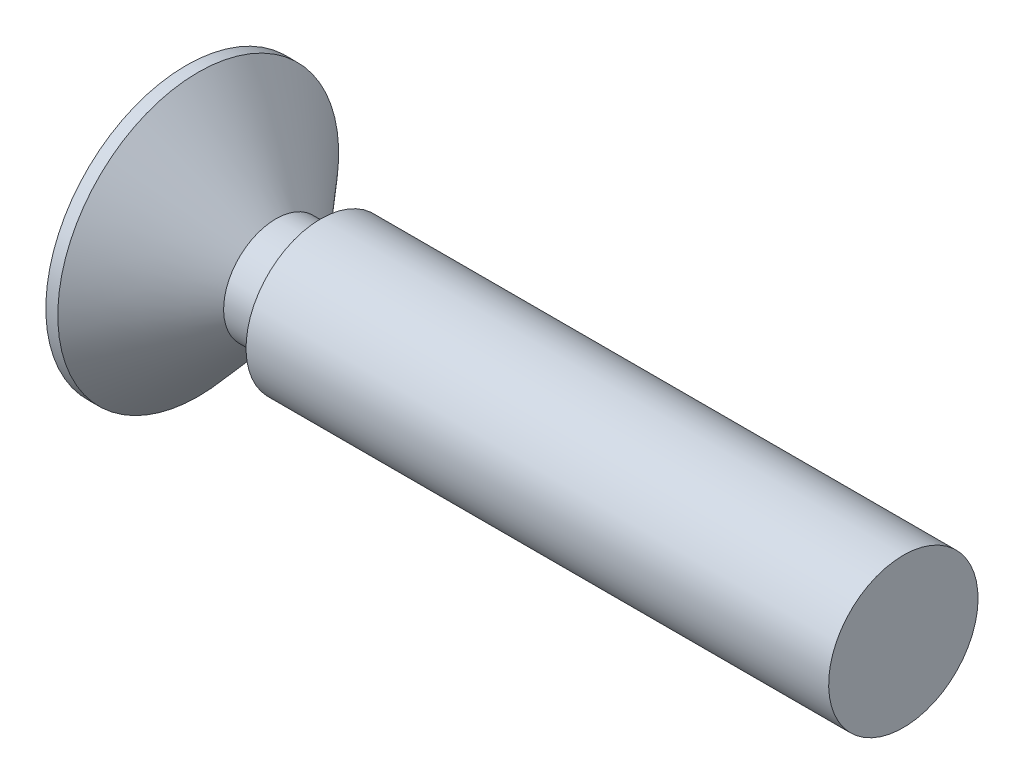
ISO-10303-21;
HEADER;
FILE_DESCRIPTION(('STEP AP214'),'2;1');
FILE_NAME('part.step','',(''),(''),'','','');
FILE_SCHEMA(('AUTOMOTIVE_DESIGN { 1 0 10303 214 1 1 1 1 }'));
ENDSEC;
DATA;
#1=APPLICATION_CONTEXT('core data for automotive mechanical design processes');
#2=APPLICATION_PROTOCOL_DEFINITION('international standard','automotive_design',2000,#1);
#3=PRODUCT_CONTEXT('',#1,'mechanical');
#4=PRODUCT('Part','Part','',(#3));
#5=PRODUCT_RELATED_PRODUCT_CATEGORY('part','',(#4));
#6=PRODUCT_DEFINITION_FORMATION('','',#4);
#7=PRODUCT_DEFINITION_CONTEXT('part definition',#1,'design');
#8=PRODUCT_DEFINITION('design','',#6,#7);
#9=PRODUCT_DEFINITION_SHAPE('','',#8);
#10=(LENGTH_UNIT() NAMED_UNIT(*) SI_UNIT(.MILLI.,.METRE.));
#11=(NAMED_UNIT(*) PLANE_ANGLE_UNIT() SI_UNIT($,.RADIAN.));
#12=(NAMED_UNIT(*) SI_UNIT($,.STERADIAN.) SOLID_ANGLE_UNIT());
#13=UNCERTAINTY_MEASURE_WITH_UNIT(LENGTH_MEASURE(1.E-05),#10,'distance_accuracy_value','');
#14=(GEOMETRIC_REPRESENTATION_CONTEXT(3) GLOBAL_UNCERTAINTY_ASSIGNED_CONTEXT((#13)) GLOBAL_UNIT_ASSIGNED_CONTEXT((#10,
#11,#12)) REPRESENTATION_CONTEXT('',''));
#15=CARTESIAN_POINT('',(0.,0.,0.));
#16=DIRECTION('',(0.,0.,1.));
#17=DIRECTION('',(1.,0.,0.));
#18=AXIS2_PLACEMENT_3D('',#15,#16,#17);
#19=CARTESIAN_POINT('',(0.,0.,0.));
#20=DIRECTION('',(1.,0.,0.));
#21=DIRECTION('',(0.,1.,0.));
#22=AXIS2_PLACEMENT_3D('',#19,#20,#21);
#23=PLANE('',#22);
#24=CARTESIAN_POINT('',(0.,0.,0.));
#25=DIRECTION('',(1.,0.,0.));
#26=DIRECTION('',(0.,1.,0.));
#27=AXIS2_PLACEMENT_3D('',#24,#25,#26);
#28=CIRCLE('',#27,1.25);
#29=CARTESIAN_POINT('',(0.,1.25,0.));
#30=VERTEX_POINT('',#29);
#31=EDGE_CURVE('E11',#30,#30,#28,.T.);
#32=ORIENTED_EDGE('',*,*,#31,.T.);
#33=EDGE_LOOP('',(#32));
#34=FACE_BOUND('',#33,.T.);
#35=ADVANCED_FACE('F42',(#34),#23,.T.);
#36=CARTESIAN_POINT('',(0.,0.,0.));
#37=DIRECTION('',(1.,0.,0.));
#38=DIRECTION('',(0.,1.,0.));
#39=AXIS2_PLACEMENT_3D('',#36,#37,#38);
#40=CYLINDRICAL_SURFACE('',#39,1.25);
#41=CARTESIAN_POINT('',(-9.75,0.,0.));
#42=DIRECTION('',(1.,0.,0.));
#43=DIRECTION('',(0.,1.,0.));
#44=AXIS2_PLACEMENT_3D('',#41,#42,#43);
#45=CIRCLE('',#44,1.25000000000001);
#46=CARTESIAN_POINT('',(-9.75,1.25,0.));
#47=VERTEX_POINT('',#46);
#48=EDGE_CURVE('E50',#47,#47,#45,.T.);
#49=ORIENTED_EDGE('',*,*,#48,.T.);
#50=EDGE_LOOP('',(#49));
#51=FACE_BOUND('',#50,.T.);
#52=ORIENTED_EDGE('',*,*,#31,.F.);
#53=EDGE_LOOP('',(#52));
#54=FACE_BOUND('',#53,.T.);
#55=ADVANCED_FACE('F315',(#51,#54),#40,.T.);
#56=CARTESIAN_POINT('',(-9.75,1.25,0.));
#57=DIRECTION('',(-1.,0.,0.));
#58=DIRECTION('',(0.,-1.,0.));
#59=AXIS2_PLACEMENT_3D('',#56,#57,#58);
#60=PLANE('',#59);
#61=CARTESIAN_POINT('',(-9.75,0.,0.));
#62=DIRECTION('',(1.,0.,0.));
#63=DIRECTION('',(0.,1.,0.));
#64=AXIS2_PLACEMENT_3D('',#61,#62,#63);
#65=CIRCLE('',#64,0.875000000000006);
#66=CARTESIAN_POINT('',(-9.75,0.875000000000004,0.));
#67=VERTEX_POINT('',#66);
#68=EDGE_CURVE('E308',#67,#67,#65,.T.);
#69=ORIENTED_EDGE('',*,*,#68,.T.);
#70=EDGE_LOOP('',(#69));
#71=FACE_BOUND('',#70,.T.);
#72=ORIENTED_EDGE('',*,*,#48,.F.);
#73=EDGE_LOOP('',(#72));
#74=FACE_BOUND('',#73,.T.);
#75=ADVANCED_FACE('F318',(#71,#74),#60,.T.);
#76=CARTESIAN_POINT('',(0.,0.,0.));
#77=DIRECTION('',(1.,0.,0.));
#78=DIRECTION('',(0.,1.,0.));
#79=AXIS2_PLACEMENT_3D('',#76,#77,#78);
#80=CYLINDRICAL_SURFACE('',#79,0.875000000000006);
#81=CARTESIAN_POINT('',(-10.5,0.,0.));
#82=DIRECTION('',(1.,0.,0.));
#83=DIRECTION('',(0.,1.,0.));
#84=AXIS2_PLACEMENT_3D('',#81,#82,#83);
#85=CIRCLE('',#84,0.875000000000006);
#86=CARTESIAN_POINT('',(-10.5,0.875000000000004,0.));
#87=VERTEX_POINT('',#86);
#88=EDGE_CURVE('E304',#87,#87,#85,.T.);
#89=ORIENTED_EDGE('',*,*,#88,.T.);
#90=EDGE_LOOP('',(#89));
#91=FACE_BOUND('',#90,.T.);
#92=ORIENTED_EDGE('',*,*,#68,.F.);
#93=EDGE_LOOP('',(#92));
#94=FACE_BOUND('',#93,.T.);
#95=ADVANCED_FACE('F320',(#91,#94),#80,.T.);
#96=CARTESIAN_POINT('',(-10.5,0.,0.));
#97=DIRECTION('',(-1.,0.,0.));
#98=DIRECTION('',(0.,-1.,0.));
#99=AXIS2_PLACEMENT_3D('',#96,#97,#98);
#100=CONICAL_SURFACE('',#99,0.875000000000006,0.848377825830391);
#101=CARTESIAN_POINT('',(-11.8,0.,0.));
#102=DIRECTION('',(1.,0.,0.));
#103=DIRECTION('',(0.,1.,0.));
#104=AXIS2_PLACEMENT_3D('',#101,#102,#103);
#105=CIRCLE('',#104,2.35);
#106=CARTESIAN_POINT('',(-11.8,2.35,0.));
#107=VERTEX_POINT('',#106);
#108=EDGE_CURVE('E300',#107,#107,#105,.T.);
#109=ORIENTED_EDGE('',*,*,#108,.T.);
#110=EDGE_LOOP('',(#109));
#111=FACE_BOUND('',#110,.T.);
#112=ORIENTED_EDGE('',*,*,#88,.F.);
#113=EDGE_LOOP('',(#112));
#114=FACE_BOUND('',#113,.T.);
#115=ADVANCED_FACE('F327',(#111,#114),#100,.T.);
#116=CARTESIAN_POINT('',(0.,0.,0.));
#117=DIRECTION('',(1.,0.,0.));
#118=DIRECTION('',(0.,1.,0.));
#119=AXIS2_PLACEMENT_3D('',#116,#117,#118);
#120=CYLINDRICAL_SURFACE('',#119,2.35);
#121=CARTESIAN_POINT('',(-12.,0.,0.));
#122=DIRECTION('',(1.,0.,0.));
#123=DIRECTION('',(0.,1.,0.));
#124=AXIS2_PLACEMENT_3D('',#121,#122,#123);
#125=CIRCLE('',#124,2.35);
#126=CARTESIAN_POINT('',(-12.,2.35,0.));
#127=VERTEX_POINT('',#126);
#128=EDGE_CURVE('E257',#127,#127,#125,.T.);
#129=ORIENTED_EDGE('',*,*,#128,.T.);
#130=EDGE_LOOP('',(#129));
#131=FACE_BOUND('',#130,.T.);
#132=ORIENTED_EDGE('',*,*,#108,.F.);
#133=EDGE_LOOP('',(#132));
#134=FACE_BOUND('',#133,.T.);
#135=ADVANCED_FACE('F353',(#131,#134),#120,.T.);
#136=CARTESIAN_POINT('',(-12.,2.35,0.));
#137=DIRECTION('',(-1.,0.,0.));
#138=DIRECTION('',(0.,-1.,0.));
#139=AXIS2_PLACEMENT_3D('',#136,#137,#138);
#140=PLANE('',#139);
#141=DIRECTION('',(0.,-1.,0.));
#142=VECTOR('',#141,1.);
#143=CARTESIAN_POINT('',(-12.,1.5,-0.3125));
#144=LINE('',#143,#142);
#145=CARTESIAN_POINT('',(-12.,1.5,-0.3125));
#146=VERTEX_POINT('',#145);
#147=CARTESIAN_POINT('',(-12.,0.562499999999999,-0.3125));
#148=VERTEX_POINT('',#147);
#149=EDGE_CURVE('E57',#146,#148,#144,.T.);
#150=ORIENTED_EDGE('',*,*,#149,.F.);
#151=DIRECTION('',(0.,0.,-1.));
#152=VECTOR('',#151,1.);
#153=CARTESIAN_POINT('',(-12.,1.5,-0.3125));
#154=LINE('',#153,#152);
#155=CARTESIAN_POINT('',(-12.,1.5,0.3125));
#156=VERTEX_POINT('',#155);
#157=EDGE_CURVE('E251',#156,#146,#154,.T.);
#158=ORIENTED_EDGE('',*,*,#157,.F.);
#159=DIRECTION('',(0.,1.,0.));
#160=VECTOR('',#159,1.);
#161=CARTESIAN_POINT('',(-12.,1.5,0.3125));
#162=LINE('',#161,#160);
#163=CARTESIAN_POINT('',(-12.,0.562499999999999,0.3125));
#164=VERTEX_POINT('',#163);
#165=EDGE_CURVE('E248',#164,#156,#162,.T.);
#166=ORIENTED_EDGE('',*,*,#165,.F.);
#167=CARTESIAN_POINT('',(-12.,0.562499999999998,0.5625));
#168=DIRECTION('',(1.,0.,0.));
#169=DIRECTION('',(0.,1.,0.));
#170=AXIS2_PLACEMENT_3D('',#167,#168,#169);
#171=CIRCLE('',#170,0.25);
#172=CARTESIAN_POINT('',(-12.,0.312499999999998,0.5625));
#173=VERTEX_POINT('',#172);
#174=EDGE_CURVE('E165',#173,#164,#171,.T.);
#175=ORIENTED_EDGE('',*,*,#174,.F.);
#176=DIRECTION('',(0.,0.,-1.));
#177=VECTOR('',#176,1.);
#178=CARTESIAN_POINT('',(-12.,0.312499999999999,0.5625));
#179=LINE('',#178,#177);
#180=CARTESIAN_POINT('',(-12.,0.312499999999999,1.5));
#181=VERTEX_POINT('',#180);
#182=EDGE_CURVE('E242',#181,#173,#179,.T.);
#183=ORIENTED_EDGE('',*,*,#182,.F.);
#184=DIRECTION('',(0.,1.,0.));
#185=VECTOR('',#184,1.);
#186=CARTESIAN_POINT('',(-12.,0.312499999999999,1.5));
#187=LINE('',#186,#185);
#188=CARTESIAN_POINT('',(-12.,-0.312500000000001,1.5));
#189=VERTEX_POINT('',#188);
#190=EDGE_CURVE('E238',#189,#181,#187,.T.);
#191=ORIENTED_EDGE('',*,*,#190,.F.);
#192=DIRECTION('',(0.,0.,1.));
#193=VECTOR('',#192,1.);
#194=CARTESIAN_POINT('',(-12.,-0.312500000000001,0.562500000000001));
#195=LINE('',#194,#193);
#196=CARTESIAN_POINT('',(-12.,-0.312500000000001,0.562500000000001));
#197=VERTEX_POINT('',#196);
#198=EDGE_CURVE('E234',#197,#189,#195,.T.);
#199=ORIENTED_EDGE('',*,*,#198,.F.);
#200=CARTESIAN_POINT('',(-12.,-0.562500000000001,0.5625));
#201=DIRECTION('',(1.,0.,0.));
#202=DIRECTION('',(0.,1.,0.));
#203=AXIS2_PLACEMENT_3D('',#200,#201,#202);
#204=CIRCLE('',#203,0.25);
#205=CARTESIAN_POINT('',(-12.,-0.562500000000002,0.3125));
#206=VERTEX_POINT('',#205);
#207=EDGE_CURVE('E230',#206,#197,#204,.T.);
#208=ORIENTED_EDGE('',*,*,#207,.F.);
#209=DIRECTION('',(0.,1.,0.));
#210=VECTOR('',#209,1.);
#211=CARTESIAN_POINT('',(-12.,-0.562500000000002,0.312500000000001));
#212=LINE('',#211,#210);
#213=CARTESIAN_POINT('',(-12.,-1.5,0.3125));
#214=VERTEX_POINT('',#213);
#215=EDGE_CURVE('E226',#214,#206,#212,.T.);
#216=ORIENTED_EDGE('',*,*,#215,.F.);
#217=DIRECTION('',(0.,0.,1.));
#218=VECTOR('',#217,1.);
#219=CARTESIAN_POINT('',(-12.,-1.5,-0.3125));
#220=LINE('',#219,#218);
#221=CARTESIAN_POINT('',(-12.,-1.5,-0.3125));
#222=VERTEX_POINT('',#221);
#223=EDGE_CURVE('E222',#222,#214,#220,.T.);
#224=ORIENTED_EDGE('',*,*,#223,.F.);
#225=DIRECTION('',(0.,-1.,0.));
#226=VECTOR('',#225,1.);
#227=CARTESIAN_POINT('',(-12.,-0.562500000000002,-0.3125));
#228=LINE('',#227,#226);
#229=CARTESIAN_POINT('',(-12.,-0.562500000000002,-0.3125));
#230=VERTEX_POINT('',#229);
#231=EDGE_CURVE('E218',#230,#222,#228,.T.);
#232=ORIENTED_EDGE('',*,*,#231,.F.);
#233=CARTESIAN_POINT('',(-12.,-0.562500000000001,-0.5625));
#234=DIRECTION('',(1.,0.,0.));
#235=DIRECTION('',(0.,-1.,0.));
#236=AXIS2_PLACEMENT_3D('',#233,#234,#235);
#237=CIRCLE('',#236,0.25);
#238=CARTESIAN_POINT('',(-12.,-0.312500000000001,-0.5625));
#239=VERTEX_POINT('',#238);
#240=EDGE_CURVE('E214',#239,#230,#237,.T.);
#241=ORIENTED_EDGE('',*,*,#240,.F.);
#242=DIRECTION('',(0.,0.,1.));
#243=VECTOR('',#242,1.);
#244=CARTESIAN_POINT('',(-12.,-0.312500000000001,-1.5));
#245=LINE('',#244,#243);
#246=CARTESIAN_POINT('',(-12.,-0.312500000000001,-1.5));
#247=VERTEX_POINT('',#246);
#248=EDGE_CURVE('E210',#247,#239,#245,.T.);
#249=ORIENTED_EDGE('',*,*,#248,.F.);
#250=DIRECTION('',(0.,-1.,0.));
#251=VECTOR('',#250,1.);
#252=CARTESIAN_POINT('',(-12.,0.312499999999999,-1.5));
#253=LINE('',#252,#251);
#254=CARTESIAN_POINT('',(-12.,0.312499999999999,-1.5));
#255=VERTEX_POINT('',#254);
#256=EDGE_CURVE('E206',#255,#247,#253,.T.);
#257=ORIENTED_EDGE('',*,*,#256,.F.);
#258=DIRECTION('',(0.,0.,-1.));
#259=VECTOR('',#258,1.);
#260=CARTESIAN_POINT('',(-12.,0.312499999999999,-1.5));
#261=LINE('',#260,#259);
#262=CARTESIAN_POINT('',(-12.,0.312499999999999,-0.5625));
#263=VERTEX_POINT('',#262);
#264=EDGE_CURVE('E203',#263,#255,#261,.T.);
#265=ORIENTED_EDGE('',*,*,#264,.F.);
#266=CARTESIAN_POINT('',(-12.,0.562499999999998,-0.5625));
#267=DIRECTION('',(1.,0.,0.));
#268=DIRECTION('',(0.,1.,0.));
#269=AXIS2_PLACEMENT_3D('',#266,#267,#268);
#270=CIRCLE('',#269,0.25);
#271=EDGE_CURVE('E199',#148,#263,#270,.T.);
#272=ORIENTED_EDGE('',*,*,#271,.F.);
#273=EDGE_LOOP('',(#150,#158,#166,#175,#183,#191,#199,#208,#216,#224,#232,#241,#249,#257,#265,#272));
#274=FACE_BOUND('',#273,.T.);
#275=ORIENTED_EDGE('',*,*,#128,.F.);
#276=EDGE_LOOP('',(#275));
#277=FACE_BOUND('',#276,.T.);
#278=ADVANCED_FACE('F362',(#274,#277),#140,.T.);
#279=CARTESIAN_POINT('',(-11.25,1.5,-0.3125));
#280=DIRECTION('',(0.,0.,-1.));
#281=DIRECTION('',(-1.,0.,0.));
#282=AXIS2_PLACEMENT_3D('',#279,#280,#281);
#283=PLANE('',#282);
#284=ORIENTED_EDGE('',*,*,#149,.T.);
#285=DIRECTION('',(-1.,0.,0.));
#286=VECTOR('',#285,1.);
#287=CARTESIAN_POINT('',(-11.25,0.562499999999999,-0.3125));
#288=LINE('',#287,#286);
#289=CARTESIAN_POINT('',(-11.25,0.562499999999999,-0.3125));
#290=VERTEX_POINT('',#289);
#291=EDGE_CURVE('E117',#290,#148,#288,.T.);
#292=ORIENTED_EDGE('',*,*,#291,.F.);
#293=DIRECTION('',(0.,-1.,0.));
#294=VECTOR('',#293,1.);
#295=CARTESIAN_POINT('',(-11.25,1.5,-0.3125));
#296=LINE('',#295,#294);
#297=CARTESIAN_POINT('',(-11.25,1.5,-0.3125));
#298=VERTEX_POINT('',#297);
#299=EDGE_CURVE('E254',#298,#290,#296,.T.);
#300=ORIENTED_EDGE('',*,*,#299,.F.);
#301=DIRECTION('',(-1.,0.,0.));
#302=VECTOR('',#301,1.);
#303=CARTESIAN_POINT('',(-11.25,1.5,-0.3125));
#304=LINE('',#303,#302);
#305=EDGE_CURVE('E65',#298,#146,#304,.T.);
#306=ORIENTED_EDGE('',*,*,#305,.T.);
#307=EDGE_LOOP('',(#284,#292,#300,#306));
#308=FACE_BOUND('',#307,.T.);
#309=ADVANCED_FACE('F371',(#308),#283,.F.);
#310=CARTESIAN_POINT('',(-11.25,1.5,-0.3125));
#311=DIRECTION('',(0.,1.,0.));
#312=DIRECTION('',(-1.,0.,0.));
#313=AXIS2_PLACEMENT_3D('',#310,#311,#312);
#314=PLANE('',#313);
#315=ORIENTED_EDGE('',*,*,#157,.T.);
#316=ORIENTED_EDGE('',*,*,#305,.F.);
#317=DIRECTION('',(0.,0.,-1.));
#318=VECTOR('',#317,1.);
#319=CARTESIAN_POINT('',(-11.25,1.5,-0.3125));
#320=LINE('',#319,#318);
#321=CARTESIAN_POINT('',(-11.25,1.5,0.3125));
#322=VERTEX_POINT('',#321);
#323=EDGE_CURVE('E179',#322,#298,#320,.T.);
#324=ORIENTED_EDGE('',*,*,#323,.F.);
#325=DIRECTION('',(-1.,0.,0.));
#326=VECTOR('',#325,1.);
#327=CARTESIAN_POINT('',(-11.25,1.5,0.3125));
#328=LINE('',#327,#326);
#329=EDGE_CURVE('E170',#322,#156,#328,.T.);
#330=ORIENTED_EDGE('',*,*,#329,.T.);
#331=EDGE_LOOP('',(#315,#316,#324,#330));
#332=FACE_BOUND('',#331,.T.);
#333=ADVANCED_FACE('F380',(#332),#314,.F.);
#334=CARTESIAN_POINT('',(-11.25,1.5,0.3125));
#335=DIRECTION('',(0.,0.,1.));
#336=DIRECTION('',(0.,-1.,0.));
#337=AXIS2_PLACEMENT_3D('',#334,#335,#336);
#338=PLANE('',#337);
#339=ORIENTED_EDGE('',*,*,#165,.T.);
#340=ORIENTED_EDGE('',*,*,#329,.F.);
#341=DIRECTION('',(0.,1.,0.));
#342=VECTOR('',#341,1.);
#343=CARTESIAN_POINT('',(-11.25,1.5,0.3125));
#344=LINE('',#343,#342);
#345=CARTESIAN_POINT('',(-11.25,0.562499999999999,0.3125));
#346=VERTEX_POINT('',#345);
#347=EDGE_CURVE('E174',#346,#322,#344,.T.);
#348=ORIENTED_EDGE('',*,*,#347,.F.);
#349=DIRECTION('',(-1.,0.,0.));
#350=VECTOR('',#349,1.);
#351=CARTESIAN_POINT('',(-11.25,0.562499999999999,0.3125));
#352=LINE('',#351,#350);
#353=EDGE_CURVE('E158',#346,#164,#352,.T.);
#354=ORIENTED_EDGE('',*,*,#353,.T.);
#355=EDGE_LOOP('',(#339,#340,#348,#354));
#356=FACE_BOUND('',#355,.T.);
#357=ADVANCED_FACE('F175',(#356),#338,.F.);
#358=CARTESIAN_POINT('',(-11.25,0.562499999999998,0.5625));
#359=DIRECTION('',(-1.,0.,0.));
#360=DIRECTION('',(0.,-1.,0.));
#361=AXIS2_PLACEMENT_3D('',#358,#359,#360);
#362=CYLINDRICAL_SURFACE('',#361,0.25);
#363=ORIENTED_EDGE('',*,*,#174,.T.);
#364=ORIENTED_EDGE('',*,*,#353,.F.);
#365=CARTESIAN_POINT('',(-11.25,0.562499999999998,0.5625));
#366=DIRECTION('',(1.,0.,0.));
#367=DIRECTION('',(0.,1.,0.));
#368=AXIS2_PLACEMENT_3D('',#365,#366,#367);
#369=CIRCLE('',#368,0.25);
#370=CARTESIAN_POINT('',(-11.25,0.312499999999998,0.5625));
#371=VERTEX_POINT('',#370);
#372=EDGE_CURVE('E162',#371,#346,#369,.T.);
#373=ORIENTED_EDGE('',*,*,#372,.F.);
#374=DIRECTION('',(-1.,0.,0.));
#375=VECTOR('',#374,1.);
#376=CARTESIAN_POINT('',(-11.25,0.312499999999998,0.5625));
#377=LINE('',#376,#375);
#378=EDGE_CURVE('E171',#371,#173,#377,.T.);
#379=ORIENTED_EDGE('',*,*,#378,.T.);
#380=EDGE_LOOP('',(#363,#364,#373,#379));
#381=FACE_BOUND('',#380,.T.);
#382=ADVANCED_FACE('F160',(#381),#362,.T.);
#383=CARTESIAN_POINT('',(-11.25,0.312499999999999,0.5625));
#384=DIRECTION('',(0.,1.,0.));
#385=DIRECTION('',(-1.,0.,0.));
#386=AXIS2_PLACEMENT_3D('',#383,#384,#385);
#387=PLANE('',#386);
#388=ORIENTED_EDGE('',*,*,#182,.T.);
#389=ORIENTED_EDGE('',*,*,#378,.F.);
#390=DIRECTION('',(0.,0.,-1.));
#391=VECTOR('',#390,1.);
#392=CARTESIAN_POINT('',(-11.25,0.312499999999999,0.5625));
#393=LINE('',#392,#391);
#394=CARTESIAN_POINT('',(-11.25,0.312499999999999,1.5));
#395=VERTEX_POINT('',#394);
#396=EDGE_CURVE('E185',#395,#371,#393,.T.);
#397=ORIENTED_EDGE('',*,*,#396,.F.);
#398=DIRECTION('',(-1.,0.,0.));
#399=VECTOR('',#398,1.);
#400=CARTESIAN_POINT('',(-11.25,0.312499999999999,1.5));
#401=LINE('',#400,#399);
#402=EDGE_CURVE('E262',#395,#181,#401,.T.);
#403=ORIENTED_EDGE('',*,*,#402,.T.);
#404=EDGE_LOOP('',(#388,#389,#397,#403));
#405=FACE_BOUND('',#404,.T.);
#406=ADVANCED_FACE('F402',(#405),#387,.F.);
#407=CARTESIAN_POINT('',(-11.25,0.312499999999999,1.5));
#408=DIRECTION('',(0.,0.,1.));
#409=DIRECTION('',(0.,-1.,0.));
#410=AXIS2_PLACEMENT_3D('',#407,#408,#409);
#411=PLANE('',#410);
#412=ORIENTED_EDGE('',*,*,#190,.T.);
#413=ORIENTED_EDGE('',*,*,#402,.F.);
#414=DIRECTION('',(0.,1.,0.));
#415=VECTOR('',#414,1.);
#416=CARTESIAN_POINT('',(-11.25,0.312499999999999,1.5));
#417=LINE('',#416,#415);
#418=CARTESIAN_POINT('',(-11.25,-0.312500000000001,1.5));
#419=VERTEX_POINT('',#418);
#420=EDGE_CURVE('E191',#419,#395,#417,.T.);
#421=ORIENTED_EDGE('',*,*,#420,.F.);
#422=DIRECTION('',(-1.,0.,0.));
#423=VECTOR('',#422,1.);
#424=CARTESIAN_POINT('',(-11.25,-0.312500000000001,1.5));
#425=LINE('',#424,#423);
#426=EDGE_CURVE('E265',#419,#189,#425,.T.);
#427=ORIENTED_EDGE('',*,*,#426,.T.);
#428=EDGE_LOOP('',(#412,#413,#421,#427));
#429=FACE_BOUND('',#428,.T.);
#430=ADVANCED_FACE('F410',(#429),#411,.F.);
#431=CARTESIAN_POINT('',(-11.25,-0.312500000000001,0.562500000000001));
#432=DIRECTION('',(0.,-1.,0.));
#433=DIRECTION('',(1.,0.,0.));
#434=AXIS2_PLACEMENT_3D('',#431,#432,#433);
#435=PLANE('',#434);
#436=ORIENTED_EDGE('',*,*,#198,.T.);
#437=ORIENTED_EDGE('',*,*,#426,.F.);
#438=DIRECTION('',(0.,0.,1.));
#439=VECTOR('',#438,1.);
#440=CARTESIAN_POINT('',(-11.25,-0.312500000000001,0.562500000000001));
#441=LINE('',#440,#439);
#442=CARTESIAN_POINT('',(-11.25,-0.312500000000001,0.562500000000001));
#443=VERTEX_POINT('',#442);
#444=EDGE_CURVE('E617',#443,#419,#441,.T.);
#445=ORIENTED_EDGE('',*,*,#444,.F.);
#446=DIRECTION('',(-1.,0.,0.));
#447=VECTOR('',#446,1.);
#448=CARTESIAN_POINT('',(-11.25,-0.312500000000001,0.562500000000001));
#449=LINE('',#448,#447);
#450=EDGE_CURVE('E268',#443,#197,#449,.T.);
#451=ORIENTED_EDGE('',*,*,#450,.T.);
#452=EDGE_LOOP('',(#436,#437,#445,#451));
#453=FACE_BOUND('',#452,.T.);
#454=ADVANCED_FACE('F419',(#453),#435,.F.);
#455=CARTESIAN_POINT('',(-11.25,-0.562500000000001,0.5625));
#456=DIRECTION('',(-1.,0.,0.));
#457=DIRECTION('',(0.,-1.,0.));
#458=AXIS2_PLACEMENT_3D('',#455,#456,#457);
#459=CYLINDRICAL_SURFACE('',#458,0.25);
#460=ORIENTED_EDGE('',*,*,#207,.T.);
#461=ORIENTED_EDGE('',*,*,#450,.F.);
#462=CARTESIAN_POINT('',(-11.25,-0.562500000000001,0.5625));
#463=DIRECTION('',(1.,0.,0.));
#464=DIRECTION('',(0.,1.,0.));
#465=AXIS2_PLACEMENT_3D('',#462,#463,#464);
#466=CIRCLE('',#465,0.25);
#467=CARTESIAN_POINT('',(-11.25,-0.562500000000002,0.3125));
#468=VERTEX_POINT('',#467);
#469=EDGE_CURVE('E613',#468,#443,#466,.T.);
#470=ORIENTED_EDGE('',*,*,#469,.F.);
#471=DIRECTION('',(-1.,0.,0.));
#472=VECTOR('',#471,1.);
#473=CARTESIAN_POINT('',(-11.25,-0.562500000000002,0.3125));
#474=LINE('',#473,#472);
#475=EDGE_CURVE('E271',#468,#206,#474,.T.);
#476=ORIENTED_EDGE('',*,*,#475,.T.);
#477=EDGE_LOOP('',(#460,#461,#470,#476));
#478=FACE_BOUND('',#477,.T.);
#479=ADVANCED_FACE('F428',(#478),#459,.T.);
#480=CARTESIAN_POINT('',(-11.25,-0.562500000000002,0.312500000000001));
#481=DIRECTION('',(0.,0.,1.));
#482=DIRECTION('',(0.,-1.,0.));
#483=AXIS2_PLACEMENT_3D('',#480,#481,#482);
#484=PLANE('',#483);
#485=ORIENTED_EDGE('',*,*,#215,.T.);
#486=ORIENTED_EDGE('',*,*,#475,.F.);
#487=DIRECTION('',(0.,1.,0.));
#488=VECTOR('',#487,1.);
#489=CARTESIAN_POINT('',(-11.25,-0.562500000000002,0.312500000000001));
#490=LINE('',#489,#488);
#491=CARTESIAN_POINT('',(-11.25,-1.5,0.3125));
#492=VERTEX_POINT('',#491);
#493=EDGE_CURVE('E609',#492,#468,#490,.T.);
#494=ORIENTED_EDGE('',*,*,#493,.F.);
#495=DIRECTION('',(-1.,0.,0.));
#496=VECTOR('',#495,1.);
#497=CARTESIAN_POINT('',(-11.25,-1.5,0.3125));
#498=LINE('',#497,#496);
#499=EDGE_CURVE('E274',#492,#214,#498,.T.);
#500=ORIENTED_EDGE('',*,*,#499,.T.);
#501=EDGE_LOOP('',(#485,#486,#494,#500));
#502=FACE_BOUND('',#501,.T.);
#503=ADVANCED_FACE('F437',(#502),#484,.F.);
#504=CARTESIAN_POINT('',(-11.25,-1.5,-0.3125));
#505=DIRECTION('',(0.,-1.,0.));
#506=DIRECTION('',(1.,0.,0.));
#507=AXIS2_PLACEMENT_3D('',#504,#505,#506);
#508=PLANE('',#507);
#509=ORIENTED_EDGE('',*,*,#223,.T.);
#510=ORIENTED_EDGE('',*,*,#499,.F.);
#511=DIRECTION('',(0.,0.,1.));
#512=VECTOR('',#511,1.);
#513=CARTESIAN_POINT('',(-11.25,-1.5,-0.3125));
#514=LINE('',#513,#512);
#515=CARTESIAN_POINT('',(-11.25,-1.5,-0.3125));
#516=VERTEX_POINT('',#515);
#517=EDGE_CURVE('E605',#516,#492,#514,.T.);
#518=ORIENTED_EDGE('',*,*,#517,.F.);
#519=DIRECTION('',(-1.,0.,0.));
#520=VECTOR('',#519,1.);
#521=CARTESIAN_POINT('',(-11.25,-1.5,-0.3125));
#522=LINE('',#521,#520);
#523=EDGE_CURVE('E277',#516,#222,#522,.T.);
#524=ORIENTED_EDGE('',*,*,#523,.T.);
#525=EDGE_LOOP('',(#509,#510,#518,#524));
#526=FACE_BOUND('',#525,.T.);
#527=ADVANCED_FACE('F446',(#526),#508,.F.);
#528=CARTESIAN_POINT('',(-11.25,-0.562500000000002,-0.3125));
#529=DIRECTION('',(0.,0.,-1.));
#530=DIRECTION('',(-1.,0.,0.));
#531=AXIS2_PLACEMENT_3D('',#528,#529,#530);
#532=PLANE('',#531);
#533=ORIENTED_EDGE('',*,*,#231,.T.);
#534=ORIENTED_EDGE('',*,*,#523,.F.);
#535=DIRECTION('',(0.,-1.,0.));
#536=VECTOR('',#535,1.);
#537=CARTESIAN_POINT('',(-11.25,-0.562500000000002,-0.3125));
#538=LINE('',#537,#536);
#539=CARTESIAN_POINT('',(-11.25,-0.562500000000002,-0.3125));
#540=VERTEX_POINT('',#539);
#541=EDGE_CURVE('E601',#540,#516,#538,.T.);
#542=ORIENTED_EDGE('',*,*,#541,.F.);
#543=DIRECTION('',(-1.,0.,0.));
#544=VECTOR('',#543,1.);
#545=CARTESIAN_POINT('',(-11.25,-0.562500000000002,-0.3125));
#546=LINE('',#545,#544);
#547=EDGE_CURVE('E280',#540,#230,#546,.T.);
#548=ORIENTED_EDGE('',*,*,#547,.T.);
#549=EDGE_LOOP('',(#533,#534,#542,#548));
#550=FACE_BOUND('',#549,.T.);
#551=ADVANCED_FACE('F455',(#550),#532,.F.);
#552=CARTESIAN_POINT('',(-11.25,-0.562500000000001,-0.5625));
#553=DIRECTION('',(-1.,0.,0.));
#554=DIRECTION('',(0.,-1.,0.));
#555=AXIS2_PLACEMENT_3D('',#552,#553,#554);
#556=CYLINDRICAL_SURFACE('',#555,0.25);
#557=ORIENTED_EDGE('',*,*,#240,.T.);
#558=ORIENTED_EDGE('',*,*,#547,.F.);
#559=CARTESIAN_POINT('',(-11.25,-0.562500000000001,-0.5625));
#560=DIRECTION('',(1.,0.,0.));
#561=DIRECTION('',(0.,-1.,0.));
#562=AXIS2_PLACEMENT_3D('',#559,#560,#561);
#563=CIRCLE('',#562,0.25);
#564=CARTESIAN_POINT('',(-11.25,-0.312500000000001,-0.5625));
#565=VERTEX_POINT('',#564);
#566=EDGE_CURVE('E597',#565,#540,#563,.T.);
#567=ORIENTED_EDGE('',*,*,#566,.F.);
#568=DIRECTION('',(-1.,0.,0.));
#569=VECTOR('',#568,1.);
#570=CARTESIAN_POINT('',(-11.25,-0.312500000000001,-0.5625));
#571=LINE('',#570,#569);
#572=EDGE_CURVE('E283',#565,#239,#571,.T.);
#573=ORIENTED_EDGE('',*,*,#572,.T.);
#574=EDGE_LOOP('',(#557,#558,#567,#573));
#575=FACE_BOUND('',#574,.T.);
#576=ADVANCED_FACE('F464',(#575),#556,.T.);
#577=CARTESIAN_POINT('',(-11.25,-0.312500000000001,-1.5));
#578=DIRECTION('',(0.,-1.,0.));
#579=DIRECTION('',(0.,0.,-1.));
#580=AXIS2_PLACEMENT_3D('',#577,#578,#579);
#581=PLANE('',#580);
#582=ORIENTED_EDGE('',*,*,#248,.T.);
#583=ORIENTED_EDGE('',*,*,#572,.F.);
#584=DIRECTION('',(0.,0.,1.));
#585=VECTOR('',#584,1.);
#586=CARTESIAN_POINT('',(-11.25,-0.312500000000001,-1.5));
#587=LINE('',#586,#585);
#588=CARTESIAN_POINT('',(-11.25,-0.312500000000001,-1.5));
#589=VERTEX_POINT('',#588);
#590=EDGE_CURVE('E594',#589,#565,#587,.T.);
#591=ORIENTED_EDGE('',*,*,#590,.F.);
#592=DIRECTION('',(-1.,0.,0.));
#593=VECTOR('',#592,1.);
#594=CARTESIAN_POINT('',(-11.25,-0.312500000000001,-1.5));
#595=LINE('',#594,#593);
#596=EDGE_CURVE('E286',#589,#247,#595,.T.);
#597=ORIENTED_EDGE('',*,*,#596,.T.);
#598=EDGE_LOOP('',(#582,#583,#591,#597));
#599=FACE_BOUND('',#598,.T.);
#600=ADVANCED_FACE('F473',(#599),#581,.F.);
#601=CARTESIAN_POINT('',(-11.25,0.312499999999999,-1.5));
#602=DIRECTION('',(0.,0.,-1.));
#603=DIRECTION('',(0.,1.,0.));
#604=AXIS2_PLACEMENT_3D('',#601,#602,#603);
#605=PLANE('',#604);
#606=ORIENTED_EDGE('',*,*,#256,.T.);
#607=ORIENTED_EDGE('',*,*,#596,.F.);
#608=DIRECTION('',(0.,-1.,0.));
#609=VECTOR('',#608,1.);
#610=CARTESIAN_POINT('',(-11.25,0.312499999999999,-1.5));
#611=LINE('',#610,#609);
#612=CARTESIAN_POINT('',(-11.25,0.312499999999999,-1.5));
#613=VERTEX_POINT('',#612);
#614=EDGE_CURVE('E584',#613,#589,#611,.T.);
#615=ORIENTED_EDGE('',*,*,#614,.F.);
#616=DIRECTION('',(-1.,0.,0.));
#617=VECTOR('',#616,1.);
#618=CARTESIAN_POINT('',(-11.25,0.312499999999999,-1.5));
#619=LINE('',#618,#617);
#620=EDGE_CURVE('E289',#613,#255,#619,.T.);
#621=ORIENTED_EDGE('',*,*,#620,.T.);
#622=EDGE_LOOP('',(#606,#607,#615,#621));
#623=FACE_BOUND('',#622,.T.);
#624=ADVANCED_FACE('F482',(#623),#605,.F.);
#625=CARTESIAN_POINT('',(-11.25,0.312499999999999,-1.5));
#626=DIRECTION('',(0.,1.,0.));
#627=DIRECTION('',(0.,0.,1.));
#628=AXIS2_PLACEMENT_3D('',#625,#626,#627);
#629=PLANE('',#628);
#630=ORIENTED_EDGE('',*,*,#264,.T.);
#631=ORIENTED_EDGE('',*,*,#620,.F.);
#632=DIRECTION('',(0.,0.,-1.));
#633=VECTOR('',#632,1.);
#634=CARTESIAN_POINT('',(-11.25,0.312499999999999,-1.5));
#635=LINE('',#634,#633);
#636=CARTESIAN_POINT('',(-11.25,0.312499999999999,-0.5625));
#637=VERTEX_POINT('',#636);
#638=EDGE_CURVE('E580',#637,#613,#635,.T.);
#639=ORIENTED_EDGE('',*,*,#638,.F.);
#640=DIRECTION('',(-1.,0.,0.));
#641=VECTOR('',#640,1.);
#642=CARTESIAN_POINT('',(-11.25,0.312499999999999,-0.5625));
#643=LINE('',#642,#641);
#644=EDGE_CURVE('E292',#637,#263,#643,.T.);
#645=ORIENTED_EDGE('',*,*,#644,.T.);
#646=EDGE_LOOP('',(#630,#631,#639,#645));
#647=FACE_BOUND('',#646,.T.);
#648=ADVANCED_FACE('F491',(#647),#629,.F.);
#649=CARTESIAN_POINT('',(-11.25,0.562499999999998,-0.5625));
#650=DIRECTION('',(-1.,0.,0.));
#651=DIRECTION('',(0.,-1.,0.));
#652=AXIS2_PLACEMENT_3D('',#649,#650,#651);
#653=CYLINDRICAL_SURFACE('',#652,0.25);
#654=ORIENTED_EDGE('',*,*,#271,.T.);
#655=ORIENTED_EDGE('',*,*,#644,.F.);
#656=CARTESIAN_POINT('',(-11.25,0.562499999999998,-0.5625));
#657=DIRECTION('',(1.,0.,0.));
#658=DIRECTION('',(0.,1.,0.));
#659=AXIS2_PLACEMENT_3D('',#656,#657,#658);
#660=CIRCLE('',#659,0.25);
#661=EDGE_CURVE('E585',#290,#637,#660,.T.);
#662=ORIENTED_EDGE('',*,*,#661,.F.);
#663=ORIENTED_EDGE('',*,*,#291,.T.);
#664=EDGE_LOOP('',(#654,#655,#662,#663));
#665=FACE_BOUND('',#664,.T.);
#666=ADVANCED_FACE('F500',(#665),#653,.T.);
#667=CARTESIAN_POINT('',(-11.25,0.562499999999998,-0.5625));
#668=DIRECTION('',(1.,0.,0.));
#669=DIRECTION('',(0.,1.,0.));
#670=AXIS2_PLACEMENT_3D('',#667,#668,#669);
#671=PLANE('',#670);
#672=ORIENTED_EDGE('',*,*,#299,.T.);
#673=ORIENTED_EDGE('',*,*,#661,.T.);
#674=ORIENTED_EDGE('',*,*,#638,.T.);
#675=ORIENTED_EDGE('',*,*,#614,.T.);
#676=ORIENTED_EDGE('',*,*,#590,.T.);
#677=ORIENTED_EDGE('',*,*,#566,.T.);
#678=ORIENTED_EDGE('',*,*,#541,.T.);
#679=ORIENTED_EDGE('',*,*,#517,.T.);
#680=ORIENTED_EDGE('',*,*,#493,.T.);
#681=ORIENTED_EDGE('',*,*,#469,.T.);
#682=ORIENTED_EDGE('',*,*,#444,.T.);
#683=ORIENTED_EDGE('',*,*,#420,.T.);
#684=ORIENTED_EDGE('',*,*,#396,.T.);
#685=ORIENTED_EDGE('',*,*,#372,.T.);
#686=ORIENTED_EDGE('',*,*,#347,.T.);
#687=ORIENTED_EDGE('',*,*,#323,.T.);
#688=EDGE_LOOP('',(#672,#673,#674,#675,#676,#677,#678,#679,#680,#681,#682,#683,#684,#685,#686,#687));
#689=FACE_BOUND('',#688,.T.);
#690=ADVANCED_FACE('F182',(#689),#671,.F.);
#691=CLOSED_SHELL('',(#35,#55,#75,#95,#115,#135,#278,#309,#333,#357,#382,#406,#430,#454,#479,
#503,#527,#551,#576,#600,#624,#648,#666,#690));
#692=MANIFOLD_SOLID_BREP('B2',#691);
#693=ADVANCED_BREP_SHAPE_REPRESENTATION('',(#18,#692),#14);
#694=SHAPE_DEFINITION_REPRESENTATION(#9,#693);
ENDSEC;
END-ISO-10303-21;
